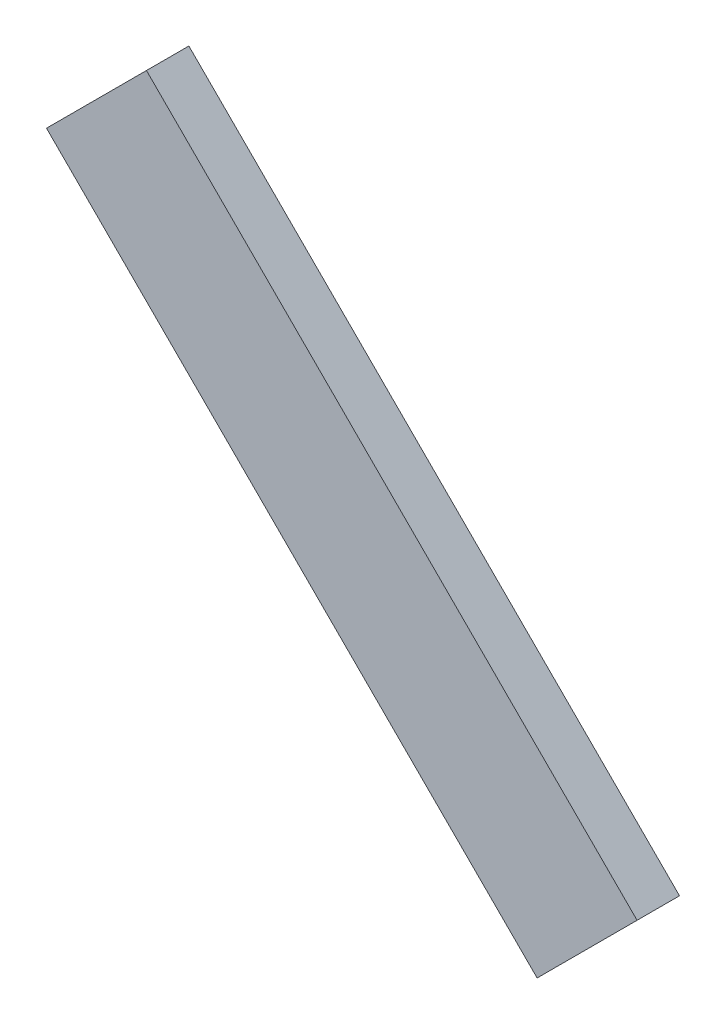
ISO-10303-21;
HEADER;
FILE_DESCRIPTION(('STEP AP214'),'2;1');
FILE_NAME('part.step','',(''),(''),'','','');
FILE_SCHEMA(('AUTOMOTIVE_DESIGN { 1 0 10303 214 1 1 1 1 }'));
ENDSEC;
DATA;
#1=APPLICATION_CONTEXT('core data for automotive mechanical design processes');
#2=APPLICATION_PROTOCOL_DEFINITION('international standard','automotive_design',2000,#1);
#3=PRODUCT_CONTEXT('',#1,'mechanical');
#4=PRODUCT('Part','Part','',(#3));
#5=PRODUCT_RELATED_PRODUCT_CATEGORY('part','',(#4));
#6=PRODUCT_DEFINITION_FORMATION('','',#4);
#7=PRODUCT_DEFINITION_CONTEXT('part definition',#1,'design');
#8=PRODUCT_DEFINITION('design','',#6,#7);
#9=PRODUCT_DEFINITION_SHAPE('','',#8);
#10=(LENGTH_UNIT() NAMED_UNIT(*) SI_UNIT(.MILLI.,.METRE.));
#11=(NAMED_UNIT(*) PLANE_ANGLE_UNIT() SI_UNIT($,.RADIAN.));
#12=(NAMED_UNIT(*) SI_UNIT($,.STERADIAN.) SOLID_ANGLE_UNIT());
#13=UNCERTAINTY_MEASURE_WITH_UNIT(LENGTH_MEASURE(1.E-05),#10,'distance_accuracy_value','');
#14=(GEOMETRIC_REPRESENTATION_CONTEXT(3) GLOBAL_UNCERTAINTY_ASSIGNED_CONTEXT((#13)) GLOBAL_UNIT_ASSIGNED_CONTEXT((#10,
#11,#12)) REPRESENTATION_CONTEXT('',''));
#15=CARTESIAN_POINT('',(0.,0.,0.));
#16=DIRECTION('',(0.,0.,1.));
#17=DIRECTION('',(1.,0.,0.));
#18=AXIS2_PLACEMENT_3D('',#15,#16,#17);
#19=CARTESIAN_POINT('',(343.458295146017,-343.458295146003,3.));
#20=DIRECTION('',(-0.707106781186561,0.707106781186534,0.));
#21=DIRECTION('',(-0.707106781186534,-0.707106781186561,0.));
#22=AXIS2_PLACEMENT_3D('',#19,#20,#21);
#23=PLANE('',#22);
#24=DIRECTION('',(0.707106781186534,0.707106781186561,0.));
#25=VECTOR('',#24,1.);
#26=CARTESIAN_POINT('',(343.458295146017,-343.458295146003,0.));
#27=LINE('',#26,#25);
#28=CARTESIAN_POINT('',(2257.29182314678,1570.37523285483,0.));
#29=VERTEX_POINT('',#28);
#30=CARTESIAN_POINT('',(2264.36289095864,1577.4463006667,0.));
#31=VERTEX_POINT('',#30);
#32=EDGE_CURVE('E103',#29,#31,#27,.T.);
#33=ORIENTED_EDGE('',*,*,#32,.F.);
#34=DIRECTION('',(0.,0.,-1.));
#35=VECTOR('',#34,1.);
#36=CARTESIAN_POINT('',(2257.29182314678,1570.37523285483,3.));
#37=LINE('',#36,#35);
#38=CARTESIAN_POINT('',(2257.29182314678,1570.37523285483,3.));
#39=VERTEX_POINT('',#38);
#40=EDGE_CURVE('E11',#39,#29,#37,.T.);
#41=ORIENTED_EDGE('',*,*,#40,.F.);
#42=DIRECTION('',(0.707106781186534,0.707106781186561,0.));
#43=VECTOR('',#42,1.);
#44=CARTESIAN_POINT('',(343.458295146017,-343.458295146003,3.));
#45=LINE('',#44,#43);
#46=CARTESIAN_POINT('',(2264.36289095864,1577.4463006667,3.));
#47=VERTEX_POINT('',#46);
#48=EDGE_CURVE('E88',#39,#47,#45,.T.);
#49=ORIENTED_EDGE('',*,*,#48,.T.);
#50=DIRECTION('',(0.,0.,-1.));
#51=VECTOR('',#50,1.);
#52=CARTESIAN_POINT('',(2264.36289095864,1577.4463006667,3.));
#53=LINE('',#52,#51);
#54=EDGE_CURVE('E56',#47,#31,#53,.T.);
#55=ORIENTED_EDGE('',*,*,#54,.T.);
#56=EDGE_LOOP('',(#33,#41,#49,#55));
#57=FACE_BOUND('',#56,.T.);
#58=ADVANCED_FACE('F40',(#57),#23,.T.);
#59=CARTESIAN_POINT('',(1913.83352800077,1913.83352800083,3.));
#60=DIRECTION('',(0.707106781186536,0.707106781186559,0.));
#61=DIRECTION('',(-0.707106781186559,0.707106781186536,0.));
#62=AXIS2_PLACEMENT_3D('',#59,#60,#61);
#63=PLANE('',#62);
#64=DIRECTION('',(0.707106781186559,-0.707106781186536,0.));
#65=VECTOR('',#64,1.);
#66=CARTESIAN_POINT('',(1913.83352800077,1913.83352800083,0.));
#67=LINE('',#66,#65);
#68=CARTESIAN_POINT('',(2291.99662396741,1535.6704320342,0.));
#69=VERTEX_POINT('',#68);
#70=EDGE_CURVE('E94',#29,#69,#67,.T.);
#71=ORIENTED_EDGE('',*,*,#70,.T.);
#72=DIRECTION('',(0.,0.,-1.));
#73=VECTOR('',#72,1.);
#74=CARTESIAN_POINT('',(2291.99662396741,1535.6704320342,3.));
#75=LINE('',#74,#73);
#76=CARTESIAN_POINT('',(2291.99662396741,1535.6704320342,3.));
#77=VERTEX_POINT('',#76);
#78=EDGE_CURVE('E48',#77,#69,#75,.T.);
#79=ORIENTED_EDGE('',*,*,#78,.F.);
#80=DIRECTION('',(0.707106781186559,-0.707106781186536,0.));
#81=VECTOR('',#80,1.);
#82=CARTESIAN_POINT('',(1913.83352800077,1913.83352800083,3.));
#83=LINE('',#82,#81);
#84=EDGE_CURVE('E82',#39,#77,#83,.T.);
#85=ORIENTED_EDGE('',*,*,#84,.F.);
#86=ORIENTED_EDGE('',*,*,#40,.T.);
#87=EDGE_LOOP('',(#71,#79,#85,#86));
#88=FACE_BOUND('',#87,.T.);
#89=ADVANCED_FACE('F92',(#88),#63,.F.);
#90=CARTESIAN_POINT('',(378.163095966744,-378.163095966699,3.));
#91=DIRECTION('',(0.707106781186589,-0.707106781186506,0.));
#92=DIRECTION('',(0.707106781186506,0.707106781186589,0.));
#93=AXIS2_PLACEMENT_3D('',#90,#91,#92);
#94=PLANE('',#93);
#95=DIRECTION('',(-0.707106781186506,-0.707106781186589,0.));
#96=VECTOR('',#95,1.);
#97=CARTESIAN_POINT('',(378.163095966744,-378.163095966699,0.));
#98=LINE('',#97,#96);
#99=CARTESIAN_POINT('',(2299.06769177928,1542.74149984606,0.));
#100=VERTEX_POINT('',#99);
#101=EDGE_CURVE('E106',#100,#69,#98,.T.);
#102=ORIENTED_EDGE('',*,*,#101,.F.);
#103=DIRECTION('',(0.,0.,-1.));
#104=VECTOR('',#103,1.);
#105=CARTESIAN_POINT('',(2299.06769177928,1542.74149984606,3.));
#106=LINE('',#105,#104);
#107=CARTESIAN_POINT('',(2299.06769177928,1542.74149984606,3.));
#108=VERTEX_POINT('',#107);
#109=EDGE_CURVE('E69',#108,#100,#106,.T.);
#110=ORIENTED_EDGE('',*,*,#109,.F.);
#111=DIRECTION('',(-0.707106781186506,-0.707106781186589,0.));
#112=VECTOR('',#111,1.);
#113=CARTESIAN_POINT('',(378.163095966744,-378.163095966699,3.));
#114=LINE('',#113,#112);
#115=EDGE_CURVE('E87',#108,#77,#114,.T.);
#116=ORIENTED_EDGE('',*,*,#115,.T.);
#117=ORIENTED_EDGE('',*,*,#78,.T.);
#118=EDGE_LOOP('',(#102,#110,#116,#117));
#119=FACE_BOUND('',#118,.T.);
#120=ADVANCED_FACE('F97',(#119),#94,.T.);
#121=CARTESIAN_POINT('',(1920.90459581266,1920.90459581267,3.));
#122=DIRECTION('',(0.707106781186545,0.70710678118655,0.));
#123=DIRECTION('',(-0.70710678118655,0.707106781186545,0.));
#124=AXIS2_PLACEMENT_3D('',#121,#122,#123);
#125=PLANE('',#124);
#126=DIRECTION('',(0.70710678118655,-0.707106781186545,0.));
#127=VECTOR('',#126,1.);
#128=CARTESIAN_POINT('',(1920.90459581266,1920.90459581267,0.));
#129=LINE('',#128,#127);
#130=EDGE_CURVE('E108',#31,#100,#129,.T.);
#131=ORIENTED_EDGE('',*,*,#130,.F.);
#132=ORIENTED_EDGE('',*,*,#54,.F.);
#133=DIRECTION('',(0.70710678118655,-0.707106781186545,0.));
#134=VECTOR('',#133,1.);
#135=CARTESIAN_POINT('',(1920.90459581266,1920.90459581267,3.));
#136=LINE('',#135,#134);
#137=EDGE_CURVE('E98',#47,#108,#136,.T.);
#138=ORIENTED_EDGE('',*,*,#137,.T.);
#139=ORIENTED_EDGE('',*,*,#109,.T.);
#140=EDGE_LOOP('',(#131,#132,#138,#139));
#141=FACE_BOUND('',#140,.T.);
#142=ADVANCED_FACE('F113',(#141),#125,.T.);
#143=CARTESIAN_POINT('',(0.,0.,3.));
#144=DIRECTION('',(0.,0.,1.));
#145=DIRECTION('',(1.,0.,0.));
#146=AXIS2_PLACEMENT_3D('',#143,#144,#145);
#147=PLANE('',#146);
#148=ORIENTED_EDGE('',*,*,#48,.F.);
#149=ORIENTED_EDGE('',*,*,#84,.T.);
#150=ORIENTED_EDGE('',*,*,#115,.F.);
#151=ORIENTED_EDGE('',*,*,#137,.F.);
#152=EDGE_LOOP('',(#148,#149,#150,#151));
#153=FACE_BOUND('',#152,.T.);
#154=ADVANCED_FACE('F84',(#153),#147,.T.);
#155=CARTESIAN_POINT('',(0.,0.,0.));
#156=DIRECTION('',(0.,0.,1.));
#157=DIRECTION('',(1.,0.,0.));
#158=AXIS2_PLACEMENT_3D('',#155,#156,#157);
#159=PLANE('',#158);
#160=ORIENTED_EDGE('',*,*,#32,.T.);
#161=ORIENTED_EDGE('',*,*,#130,.T.);
#162=ORIENTED_EDGE('',*,*,#101,.T.);
#163=ORIENTED_EDGE('',*,*,#70,.F.);
#164=EDGE_LOOP('',(#160,#161,#162,#163));
#165=FACE_BOUND('',#164,.T.);
#166=ADVANCED_FACE('F120',(#165),#159,.F.);
#167=CLOSED_SHELL('',(#58,#89,#120,#142,#154,#166));
#168=MANIFOLD_SOLID_BREP('B2',#167);
#169=ADVANCED_BREP_SHAPE_REPRESENTATION('',(#18,#168),#14);
#170=SHAPE_DEFINITION_REPRESENTATION(#9,#169);
ENDSEC;
END-ISO-10303-21;
